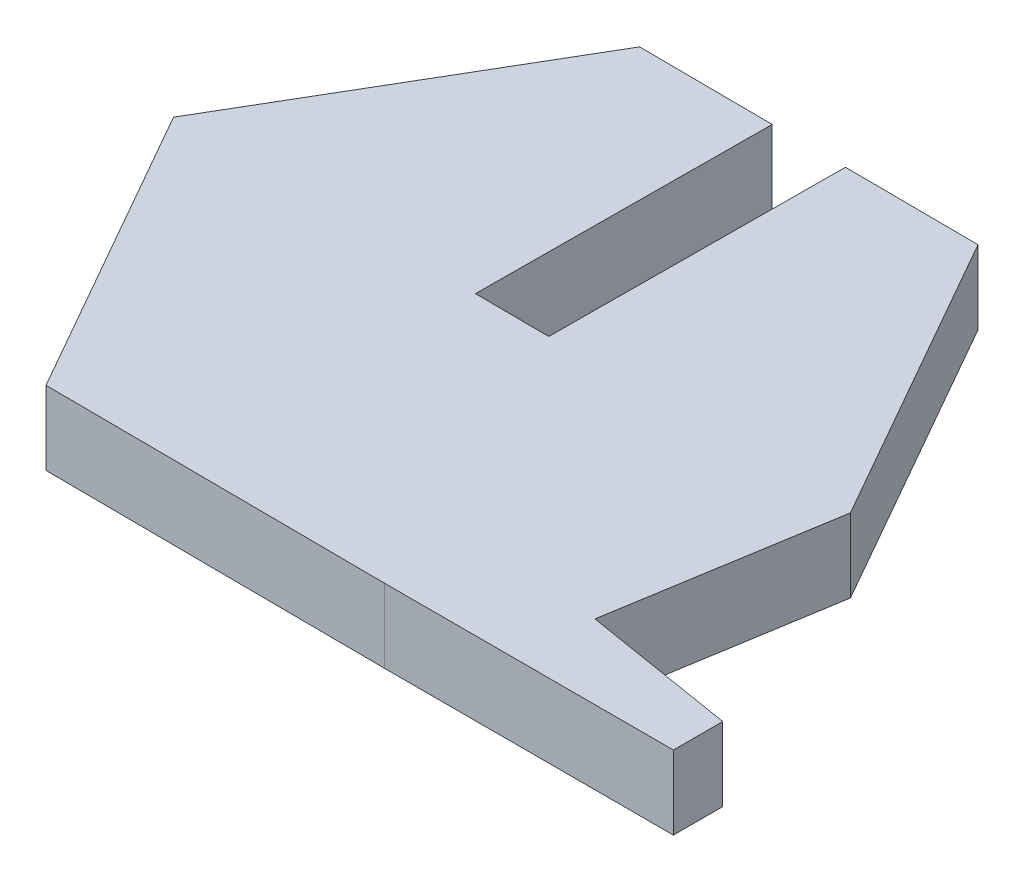
ISO-10303-21;
HEADER;
FILE_DESCRIPTION(('STEP AP214'),'2;1');
FILE_NAME('part.step','',(''),(''),'','','');
FILE_SCHEMA(('AUTOMOTIVE_DESIGN { 1 0 10303 214 1 1 1 1 }'));
ENDSEC;
DATA;
#1=APPLICATION_CONTEXT('core data for automotive mechanical design processes');
#2=APPLICATION_PROTOCOL_DEFINITION('international standard','automotive_design',2000,#1);
#3=PRODUCT_CONTEXT('',#1,'mechanical');
#4=PRODUCT('Part','Part','',(#3));
#5=PRODUCT_RELATED_PRODUCT_CATEGORY('part','',(#4));
#6=PRODUCT_DEFINITION_FORMATION('','',#4);
#7=PRODUCT_DEFINITION_CONTEXT('part definition',#1,'design');
#8=PRODUCT_DEFINITION('design','',#6,#7);
#9=PRODUCT_DEFINITION_SHAPE('','',#8);
#10=(LENGTH_UNIT() NAMED_UNIT(*) SI_UNIT(.MILLI.,.METRE.));
#11=(NAMED_UNIT(*) PLANE_ANGLE_UNIT() SI_UNIT($,.RADIAN.));
#12=(NAMED_UNIT(*) SI_UNIT($,.STERADIAN.) SOLID_ANGLE_UNIT());
#13=UNCERTAINTY_MEASURE_WITH_UNIT(LENGTH_MEASURE(1.E-05),#10,'distance_accuracy_value','');
#14=(GEOMETRIC_REPRESENTATION_CONTEXT(3) GLOBAL_UNCERTAINTY_ASSIGNED_CONTEXT((#13)) GLOBAL_UNIT_ASSIGNED_CONTEXT((#10,
#11,#12)) REPRESENTATION_CONTEXT('',''));
#15=CARTESIAN_POINT('',(0.,0.,0.));
#16=DIRECTION('',(0.,0.,1.));
#17=DIRECTION('',(1.,0.,0.));
#18=AXIS2_PLACEMENT_3D('',#15,#16,#17);
#19=CARTESIAN_POINT('',(5.83595826477384,2.5,-9.96368026710769));
#20=DIRECTION('',(-0.00625685853298923,0.,0.999980425669072));
#21=DIRECTION('',(0.999980425669072,0.,0.00625685853298923));
#22=AXIS2_PLACEMENT_3D('',#19,#20,#21);
#23=PLANE('',#22);
#24=DIRECTION('',(-0.999980425669072,0.,-0.00625685853298923));
#25=VECTOR('',#24,1.);
#26=CARTESIAN_POINT('',(5.83595826477384,2.5,-9.96368026710769));
#27=LINE('',#26,#25);
#28=CARTESIAN_POINT('',(-1.18441238916657,2.5,-10.007606592967));
#29=VERTEX_POINT('',#28);
#30=CARTESIAN_POINT('',(-5.71082109411406,2.5,-10.0359282462737));
#31=VERTEX_POINT('',#30);
#32=EDGE_CURVE('E287',#29,#31,#27,.T.);
#33=ORIENTED_EDGE('',*,*,#32,.F.);
#34=DIRECTION('',(0.,1.,0.));
#35=VECTOR('',#34,1.);
#36=CARTESIAN_POINT('',(-1.18441238916657,2.5,-10.007606592967));
#37=LINE('',#36,#35);
#38=CARTESIAN_POINT('',(-1.18441238916657,0.,-10.007606592967));
#39=VERTEX_POINT('',#38);
#40=EDGE_CURVE('E253',#39,#29,#37,.T.);
#41=ORIENTED_EDGE('',*,*,#40,.F.);
#42=DIRECTION('',(-0.999980425669072,0.,-0.00625685853298923));
#43=VECTOR('',#42,1.);
#44=CARTESIAN_POINT('',(5.83595826477384,0.,-9.96368026710769));
#45=LINE('',#44,#43);
#46=CARTESIAN_POINT('',(-5.71082109411406,0.,-10.0359282462737));
#47=VERTEX_POINT('',#46);
#48=EDGE_CURVE('E171',#39,#47,#45,.T.);
#49=ORIENTED_EDGE('',*,*,#48,.T.);
#50=DIRECTION('',(0.,-1.,0.));
#51=VECTOR('',#50,1.);
#52=CARTESIAN_POINT('',(-5.71082109411406,2.5,-10.0359282462737));
#53=LINE('',#52,#51);
#54=EDGE_CURVE('E200',#31,#47,#53,.T.);
#55=ORIENTED_EDGE('',*,*,#54,.F.);
#56=EDGE_LOOP('',(#33,#41,#49,#55));
#57=FACE_BOUND('',#56,.T.);
#58=ADVANCED_FACE('F39',(#57),#23,.F.);
#59=CARTESIAN_POINT('',(10.3298675672944,2.5,7.51644835181177));
#60=DIRECTION('',(-0.161329742323625,0.,0.986900559449529));
#61=DIRECTION('',(0.986900559449529,0.,0.161329742323625));
#62=AXIS2_PLACEMENT_3D('',#59,#60,#61);
#63=PLANE('',#62);
#64=DIRECTION('',(-0.986900559449529,0.,-0.161329742323625));
#65=VECTOR('',#64,1.);
#66=CARTESIAN_POINT('',(10.3298675672944,0.,7.51644835181177));
#67=LINE('',#66,#65);
#68=CARTESIAN_POINT('',(15.5082419016361,0.,8.36296301736289));
#69=VERTEX_POINT('',#68);
#70=CARTESIAN_POINT('',(10.3298675672944,0.,7.51644835181177));
#71=VERTEX_POINT('',#70);
#72=EDGE_CURVE('E160',#69,#71,#67,.T.);
#73=ORIENTED_EDGE('',*,*,#72,.T.);
#74=DIRECTION('',(0.,-1.,0.));
#75=VECTOR('',#74,1.);
#76=CARTESIAN_POINT('',(10.3298675672944,2.5,7.51644835181177));
#77=LINE('',#76,#75);
#78=CARTESIAN_POINT('',(10.3298675672944,2.5,7.51644835181177));
#79=VERTEX_POINT('',#78);
#80=EDGE_CURVE('E11',#79,#71,#77,.T.);
#81=ORIENTED_EDGE('',*,*,#80,.F.);
#82=DIRECTION('',(-0.986900559449529,0.,-0.161329742323625));
#83=VECTOR('',#82,1.);
#84=CARTESIAN_POINT('',(10.3298675672944,2.5,7.51644835181177));
#85=LINE('',#84,#83);
#86=CARTESIAN_POINT('',(15.5082419016361,2.5,8.36296301736289));
#87=VERTEX_POINT('',#86);
#88=EDGE_CURVE('E189',#87,#79,#85,.T.);
#89=ORIENTED_EDGE('',*,*,#88,.F.);
#90=DIRECTION('',(0.,-1.,0.));
#91=VECTOR('',#90,1.);
#92=CARTESIAN_POINT('',(15.5082419016361,2.5,8.36296301736289));
#93=LINE('',#92,#91);
#94=EDGE_CURVE('E156',#87,#69,#93,.T.);
#95=ORIENTED_EDGE('',*,*,#94,.T.);
#96=EDGE_LOOP('',(#73,#81,#89,#95));
#97=FACE_BOUND('',#96,.T.);
#98=ADVANCED_FACE('F41',(#97),#63,.F.);
#99=CARTESIAN_POINT('',(11.5467793588879,2.5,0.0722479791660558));
#100=DIRECTION('',(-0.986900559449529,0.,-0.161329742323625));
#101=DIRECTION('',(-0.161329742323625,0.,0.986900559449529));
#102=AXIS2_PLACEMENT_3D('',#99,#100,#101);
#103=PLANE('',#102);
#104=DIRECTION('',(0.161329742323625,0.,-0.986900559449529));
#105=VECTOR('',#104,1.);
#106=CARTESIAN_POINT('',(11.5467793588879,0.,0.0722479791660558));
#107=LINE('',#106,#105);
#108=CARTESIAN_POINT('',(11.5467793588879,0.,0.0722479791660558));
#109=VERTEX_POINT('',#108);
#110=EDGE_CURVE('E164',#71,#109,#107,.T.);
#111=ORIENTED_EDGE('',*,*,#110,.T.);
#112=DIRECTION('',(0.,-1.,0.));
#113=VECTOR('',#112,1.);
#114=CARTESIAN_POINT('',(11.5467793588879,2.5,0.0722479791660558));
#115=LINE('',#114,#113);
#116=CARTESIAN_POINT('',(11.5467793588879,2.5,0.0722479791660558));
#117=VERTEX_POINT('',#116);
#118=EDGE_CURVE('E48',#117,#109,#115,.T.);
#119=ORIENTED_EDGE('',*,*,#118,.F.);
#120=DIRECTION('',(0.161329742323625,0.,-0.986900559449529));
#121=VECTOR('',#120,1.);
#122=CARTESIAN_POINT('',(11.5467793588879,2.5,0.0722479791660558));
#123=LINE('',#122,#121);
#124=EDGE_CURVE('E108',#79,#117,#123,.T.);
#125=ORIENTED_EDGE('',*,*,#124,.F.);
#126=ORIENTED_EDGE('',*,*,#80,.T.);
#127=EDGE_LOOP('',(#111,#119,#125,#126));
#128=FACE_BOUND('',#127,.T.);
#129=ADVANCED_FACE('F320',(#128),#103,.F.);
#130=CARTESIAN_POINT('',(11.5467793588879,2.5,0.0722479791660558));
#131=DIRECTION('',(-0.869136881183087,0.,0.494571614397082));
#132=DIRECTION('',(0.494571614397082,0.,0.869136881183087));
#133=AXIS2_PLACEMENT_3D('',#130,#131,#132);
#134=PLANE('',#133);
#135=DIRECTION('',(-0.494571614397082,0.,-0.869136881183087));
#136=VECTOR('',#135,1.);
#137=CARTESIAN_POINT('',(11.5467793588879,0.,0.0722479791660558));
#138=LINE('',#137,#136);
#139=CARTESIAN_POINT('',(5.83595826477384,0.,-9.96368026710769));
#140=VERTEX_POINT('',#139);
#141=EDGE_CURVE('E168',#109,#140,#138,.T.);
#142=ORIENTED_EDGE('',*,*,#141,.T.);
#143=DIRECTION('',(0.,-1.,0.));
#144=VECTOR('',#143,1.);
#145=CARTESIAN_POINT('',(5.83595826477384,2.5,-9.96368026710769));
#146=LINE('',#145,#144);
#147=CARTESIAN_POINT('',(5.83595826477384,2.5,-9.96368026710769));
#148=VERTEX_POINT('',#147);
#149=EDGE_CURVE('E204',#148,#140,#146,.T.);
#150=ORIENTED_EDGE('',*,*,#149,.F.);
#151=DIRECTION('',(-0.494571614397082,0.,-0.869136881183087));
#152=VECTOR('',#151,1.);
#153=CARTESIAN_POINT('',(11.5467793588879,2.5,0.0722479791660558));
#154=LINE('',#153,#152);
#155=EDGE_CURVE('E214',#117,#148,#154,.T.);
#156=ORIENTED_EDGE('',*,*,#155,.F.);
#157=ORIENTED_EDGE('',*,*,#118,.T.);
#158=EDGE_LOOP('',(#142,#150,#156,#157));
#159=FACE_BOUND('',#158,.T.);
#160=ADVANCED_FACE('F212',(#159),#134,.F.);
#161=CARTESIAN_POINT('',(1.31553867500611,0.,-9.99196444663451));
#162=VERTEX_POINT('',#161);
#163=EDGE_CURVE('E172',#140,#162,#45,.T.);
#164=ORIENTED_EDGE('',*,*,#163,.T.);
#165=DIRECTION('',(0.,-1.,0.));
#166=VECTOR('',#165,1.);
#167=CARTESIAN_POINT('',(1.31553867500611,2.5,-9.99196444663451));
#168=LINE('',#167,#166);
#169=CARTESIAN_POINT('',(1.31553867500611,2.5,-9.99196444663451));
#170=VERTEX_POINT('',#169);
#171=EDGE_CURVE('E230',#170,#162,#168,.T.);
#172=ORIENTED_EDGE('',*,*,#171,.F.);
#173=EDGE_CURVE('E288',#148,#170,#27,.T.);
#174=ORIENTED_EDGE('',*,*,#173,.F.);
#175=ORIENTED_EDGE('',*,*,#149,.T.);
#176=EDGE_LOOP('',(#164,#172,#174,#175));
#177=FACE_BOUND('',#176,.T.);
#178=ADVANCED_FACE('F226',(#177),#23,.F.);
#179=CARTESIAN_POINT('',(-5.71082109411406,2.5,-10.0359282462737));
#180=DIRECTION('',(0.862880022650098,0.,0.50540881127199));
#181=DIRECTION('',(0.50540881127199,0.,-0.862880022650098));
#182=AXIS2_PLACEMENT_3D('',#179,#180,#181);
#183=PLANE('',#182);
#184=DIRECTION('',(-0.50540881127199,0.,0.862880022650098));
#185=VECTOR('',#184,1.);
#186=CARTESIAN_POINT('',(-5.71082109411406,0.,-10.0359282462737));
#187=LINE('',#186,#185);
#188=CARTESIAN_POINT('',(-11.5467793588879,0.,-0.0722479791660576));
#189=VERTEX_POINT('',#188);
#190=EDGE_CURVE('E176',#47,#189,#187,.T.);
#191=ORIENTED_EDGE('',*,*,#190,.T.);
#192=DIRECTION('',(0.,-1.,0.));
#193=VECTOR('',#192,1.);
#194=CARTESIAN_POINT('',(-11.5467793588879,2.5,-0.0722479791660576));
#195=LINE('',#194,#193);
#196=CARTESIAN_POINT('',(-11.5467793588879,2.5,-0.0722479791660576));
#197=VERTEX_POINT('',#196);
#198=EDGE_CURVE('E196',#197,#189,#195,.T.);
#199=ORIENTED_EDGE('',*,*,#198,.F.);
#200=DIRECTION('',(-0.50540881127199,0.,0.862880022650098));
#201=VECTOR('',#200,1.);
#202=CARTESIAN_POINT('',(-5.71082109411406,2.5,-10.0359282462737));
#203=LINE('',#202,#201);
#204=EDGE_CURVE('E291',#31,#197,#203,.T.);
#205=ORIENTED_EDGE('',*,*,#204,.F.);
#206=ORIENTED_EDGE('',*,*,#54,.T.);
#207=EDGE_LOOP('',(#191,#199,#205,#206));
#208=FACE_BOUND('',#207,.T.);
#209=ADVANCED_FACE('F302',(#208),#183,.F.);
#210=CARTESIAN_POINT('',(-11.5467793588879,2.5,-0.0722479791660576));
#211=DIRECTION('',(0.869136881183088,0.,-0.494571614397082));
#212=DIRECTION('',(-0.494571614397082,0.,-0.869136881183088));
#213=AXIS2_PLACEMENT_3D('',#210,#211,#212);
#214=PLANE('',#213);
#215=DIRECTION('',(0.494571614397082,0.,0.869136881183088));
#216=VECTOR('',#215,1.);
#217=CARTESIAN_POINT('',(-11.5467793588879,0.,-0.0722479791660576));
#218=LINE('',#217,#216);
#219=CARTESIAN_POINT('',(-5.83595826477384,0.,9.96368026710769));
#220=VERTEX_POINT('',#219);
#221=EDGE_CURVE('E179',#189,#220,#218,.T.);
#222=ORIENTED_EDGE('',*,*,#221,.T.);
#223=DIRECTION('',(0.,-1.,0.));
#224=VECTOR('',#223,1.);
#225=CARTESIAN_POINT('',(-5.83595826477384,2.5,9.96368026710769));
#226=LINE('',#225,#224);
#227=CARTESIAN_POINT('',(-5.83595826477384,2.5,9.96368026710769));
#228=VERTEX_POINT('',#227);
#229=EDGE_CURVE('E149',#228,#220,#226,.T.);
#230=ORIENTED_EDGE('',*,*,#229,.F.);
#231=DIRECTION('',(0.494571614397082,0.,0.869136881183088));
#232=VECTOR('',#231,1.);
#233=CARTESIAN_POINT('',(-11.5467793588879,2.5,-0.0722479791660576));
#234=LINE('',#233,#232);
#235=EDGE_CURVE('E135',#197,#228,#234,.T.);
#236=ORIENTED_EDGE('',*,*,#235,.F.);
#237=ORIENTED_EDGE('',*,*,#198,.T.);
#238=EDGE_LOOP('',(#222,#230,#236,#237));
#239=FACE_BOUND('',#238,.T.);
#240=ADVANCED_FACE('F306',(#239),#214,.F.);
#241=CARTESIAN_POINT('',(-5.83595826477384,2.5,9.96368026710769));
#242=DIRECTION('',(0.00625685853298938,0.,-0.999980425669072));
#243=DIRECTION('',(-0.999980425669072,0.,-0.00625685853298938));
#244=AXIS2_PLACEMENT_3D('',#241,#242,#243);
#245=PLANE('',#244);
#246=DIRECTION('',(0.999980425669072,0.,0.00625685853298938));
#247=VECTOR('',#246,1.);
#248=CARTESIAN_POINT('',(-5.83595826477384,0.,9.96368026710769));
#249=LINE('',#248,#247);
#250=CARTESIAN_POINT('',(5.71082109411406,0.,10.0359282462737));
#251=VERTEX_POINT('',#250);
#252=EDGE_CURVE('E145',#220,#251,#249,.T.);
#253=ORIENTED_EDGE('',*,*,#252,.T.);
#254=DIRECTION('',(0.,-1.,0.));
#255=VECTOR('',#254,1.);
#256=CARTESIAN_POINT('',(5.71082109411406,2.5,10.0359282462737));
#257=LINE('',#256,#255);
#258=CARTESIAN_POINT('',(5.71082109411406,2.5,10.0359282462737));
#259=VERTEX_POINT('',#258);
#260=EDGE_CURVE('E142',#259,#251,#257,.T.);
#261=ORIENTED_EDGE('',*,*,#260,.F.);
#262=DIRECTION('',(0.999980425669072,0.,0.00625685853298938));
#263=VECTOR('',#262,1.);
#264=CARTESIAN_POINT('',(-5.83595826477384,2.5,9.96368026710769));
#265=LINE('',#264,#263);
#266=EDGE_CURVE('E127',#228,#259,#265,.T.);
#267=ORIENTED_EDGE('',*,*,#266,.F.);
#268=ORIENTED_EDGE('',*,*,#229,.T.);
#269=EDGE_LOOP('',(#253,#261,#267,#268));
#270=FACE_BOUND('',#269,.T.);
#271=ADVANCED_FACE('F143',(#270),#245,.F.);
#272=CARTESIAN_POINT('',(15.5082419016361,2.5,10.0359282462737));
#273=DIRECTION('',(0.,0.,-1.));
#274=DIRECTION('',(-1.,0.,0.));
#275=AXIS2_PLACEMENT_3D('',#272,#273,#274);
#276=PLANE('',#275);
#277=DIRECTION('',(1.,0.,0.));
#278=VECTOR('',#277,1.);
#279=CARTESIAN_POINT('',(15.5082419016361,0.,10.0359282462737));
#280=LINE('',#279,#278);
#281=CARTESIAN_POINT('',(15.5082419016361,0.,10.0359282462737));
#282=VERTEX_POINT('',#281);
#283=EDGE_CURVE('E184',#251,#282,#280,.T.);
#284=ORIENTED_EDGE('',*,*,#283,.T.);
#285=DIRECTION('',(0.,-1.,0.));
#286=VECTOR('',#285,1.);
#287=CARTESIAN_POINT('',(15.5082419016361,2.5,10.0359282462737));
#288=LINE('',#287,#286);
#289=CARTESIAN_POINT('',(15.5082419016361,2.5,10.0359282462737));
#290=VERTEX_POINT('',#289);
#291=EDGE_CURVE('E150',#290,#282,#288,.T.);
#292=ORIENTED_EDGE('',*,*,#291,.F.);
#293=DIRECTION('',(1.,0.,0.));
#294=VECTOR('',#293,1.);
#295=CARTESIAN_POINT('',(15.5082419016361,2.5,10.0359282462737));
#296=LINE('',#295,#294);
#297=EDGE_CURVE('E132',#259,#290,#296,.T.);
#298=ORIENTED_EDGE('',*,*,#297,.F.);
#299=ORIENTED_EDGE('',*,*,#260,.T.);
#300=EDGE_LOOP('',(#284,#292,#298,#299));
#301=FACE_BOUND('',#300,.T.);
#302=ADVANCED_FACE('F152',(#301),#276,.F.);
#303=CARTESIAN_POINT('',(15.5082419016361,2.5,8.36296301736289));
#304=DIRECTION('',(-1.,0.,0.));
#305=DIRECTION('',(0.,0.,1.));
#306=AXIS2_PLACEMENT_3D('',#303,#304,#305);
#307=PLANE('',#306);
#308=DIRECTION('',(0.,0.,-1.));
#309=VECTOR('',#308,1.);
#310=CARTESIAN_POINT('',(15.5082419016361,0.,8.36296301736289));
#311=LINE('',#310,#309);
#312=EDGE_CURVE('E100',#282,#69,#311,.T.);
#313=ORIENTED_EDGE('',*,*,#312,.T.);
#314=ORIENTED_EDGE('',*,*,#94,.F.);
#315=DIRECTION('',(0.,0.,-1.));
#316=VECTOR('',#315,1.);
#317=CARTESIAN_POINT('',(15.5082419016361,2.5,8.36296301736289));
#318=LINE('',#317,#316);
#319=EDGE_CURVE('E64',#290,#87,#318,.T.);
#320=ORIENTED_EDGE('',*,*,#319,.F.);
#321=ORIENTED_EDGE('',*,*,#291,.T.);
#322=EDGE_LOOP('',(#313,#314,#320,#321));
#323=FACE_BOUND('',#322,.T.);
#324=ADVANCED_FACE('F334',(#323),#307,.F.);
#325=CARTESIAN_POINT('',(0.,2.5,0.));
#326=DIRECTION('',(0.,-1.,0.));
#327=DIRECTION('',(0.,0.,-1.));
#328=AXIS2_PLACEMENT_3D('',#325,#326,#327);
#329=PLANE('',#328);
#330=DIRECTION('',(0.999980425669072,0.,0.00625685853298877));
#331=VECTOR('',#330,1.);
#332=CARTESIAN_POINT('',(-1.24698097449646,2.5,-0.00780233627626324));
#333=LINE('',#332,#331);
#334=CARTESIAN_POINT('',(-1.24698097449646,2.5,-0.00780233627626324));
#335=VERTEX_POINT('',#334);
#336=CARTESIAN_POINT('',(1.25297008967622,2.5,0.00783981005620868));
#337=VERTEX_POINT('',#336);
#338=EDGE_CURVE('E260',#335,#337,#333,.T.);
#339=ORIENTED_EDGE('',*,*,#338,.F.);
#340=DIRECTION('',(0.00625685853298924,0.,-0.999980425669072));
#341=VECTOR('',#340,1.);
#342=CARTESIAN_POINT('',(-1.24698097449646,2.5,-0.00780233627626324));
#343=LINE('',#342,#341);
#344=EDGE_CURVE('E248',#335,#29,#343,.T.);
#345=ORIENTED_EDGE('',*,*,#344,.T.);
#346=ORIENTED_EDGE('',*,*,#32,.T.);
#347=ORIENTED_EDGE('',*,*,#204,.T.);
#348=ORIENTED_EDGE('',*,*,#235,.T.);
#349=ORIENTED_EDGE('',*,*,#266,.T.);
#350=ORIENTED_EDGE('',*,*,#297,.T.);
#351=ORIENTED_EDGE('',*,*,#319,.T.);
#352=ORIENTED_EDGE('',*,*,#88,.T.);
#353=ORIENTED_EDGE('',*,*,#124,.T.);
#354=ORIENTED_EDGE('',*,*,#155,.T.);
#355=ORIENTED_EDGE('',*,*,#173,.T.);
#356=DIRECTION('',(0.00625685853298924,0.,-0.999980425669072));
#357=VECTOR('',#356,1.);
#358=CARTESIAN_POINT('',(1.25297008967622,2.5,0.00783981005620868));
#359=LINE('',#358,#357);
#360=EDGE_CURVE('E256',#337,#170,#359,.T.);
#361=ORIENTED_EDGE('',*,*,#360,.F.);
#362=EDGE_LOOP('',(#339,#345,#346,#347,#348,#349,#350,#351,#352,#353,#354,#355,#361));
#363=FACE_BOUND('',#362,.T.);
#364=ADVANCED_FACE('F130',(#363),#329,.F.);
#365=CARTESIAN_POINT('',(0.,0.,0.));
#366=DIRECTION('',(0.,-1.,0.));
#367=DIRECTION('',(0.,0.,-1.));
#368=AXIS2_PLACEMENT_3D('',#365,#366,#367);
#369=PLANE('',#368);
#370=DIRECTION('',(0.00625685853298924,0.,-0.999980425669072));
#371=VECTOR('',#370,1.);
#372=CARTESIAN_POINT('',(-1.24698097449646,0.,-0.00780233627626324));
#373=LINE('',#372,#371);
#374=CARTESIAN_POINT('',(-1.24698097449646,0.,-0.00780233627626324));
#375=VERTEX_POINT('',#374);
#376=EDGE_CURVE('E165',#375,#39,#373,.T.);
#377=ORIENTED_EDGE('',*,*,#376,.F.);
#378=DIRECTION('',(-0.999980425669072,0.,-0.00625685853298877));
#379=VECTOR('',#378,1.);
#380=CARTESIAN_POINT('',(-1.24698097449646,0.,-0.00780233627626324));
#381=LINE('',#380,#379);
#382=CARTESIAN_POINT('',(1.25297008967622,0.,0.00783981005621029));
#383=VERTEX_POINT('',#382);
#384=EDGE_CURVE('E257',#383,#375,#381,.T.);
#385=ORIENTED_EDGE('',*,*,#384,.F.);
#386=DIRECTION('',(0.00625685853298924,0.,-0.999980425669072));
#387=VECTOR('',#386,1.);
#388=CARTESIAN_POINT('',(1.25297008967622,0.,0.00783981005620868));
#389=LINE('',#388,#387);
#390=EDGE_CURVE('E223',#383,#162,#389,.T.);
#391=ORIENTED_EDGE('',*,*,#390,.T.);
#392=ORIENTED_EDGE('',*,*,#163,.F.);
#393=ORIENTED_EDGE('',*,*,#141,.F.);
#394=ORIENTED_EDGE('',*,*,#110,.F.);
#395=ORIENTED_EDGE('',*,*,#72,.F.);
#396=ORIENTED_EDGE('',*,*,#312,.F.);
#397=ORIENTED_EDGE('',*,*,#283,.F.);
#398=ORIENTED_EDGE('',*,*,#252,.F.);
#399=ORIENTED_EDGE('',*,*,#221,.F.);
#400=ORIENTED_EDGE('',*,*,#190,.F.);
#401=ORIENTED_EDGE('',*,*,#48,.F.);
#402=EDGE_LOOP('',(#377,#385,#391,#392,#393,#394,#395,#396,#397,#398,#399,#400,#401));
#403=FACE_BOUND('',#402,.T.);
#404=ADVANCED_FACE('F218',(#403),#369,.T.);
#405=CARTESIAN_POINT('',(-1.24698097449646,2.5,-0.00780233627626324));
#406=DIRECTION('',(-0.999980425669072,0.,-0.00625685853298924));
#407=DIRECTION('',(-0.00625685853298924,0.,0.999980425669072));
#408=AXIS2_PLACEMENT_3D('',#405,#406,#407);
#409=PLANE('',#408);
#410=ORIENTED_EDGE('',*,*,#40,.T.);
#411=ORIENTED_EDGE('',*,*,#344,.F.);
#412=DIRECTION('',(0.,1.,0.));
#413=VECTOR('',#412,1.);
#414=CARTESIAN_POINT('',(-1.24698097449646,2.5,-0.00780233627626324));
#415=LINE('',#414,#413);
#416=EDGE_CURVE('E251',#375,#335,#415,.T.);
#417=ORIENTED_EDGE('',*,*,#416,.F.);
#418=ORIENTED_EDGE('',*,*,#376,.T.);
#419=EDGE_LOOP('',(#410,#411,#417,#418));
#420=FACE_BOUND('',#419,.T.);
#421=ADVANCED_FACE('F250',(#420),#409,.F.);
#422=CARTESIAN_POINT('',(1.25297008967622,2.5,0.00783981005620868));
#423=DIRECTION('',(0.999980425669072,0.,0.00625685853298924));
#424=DIRECTION('',(0.00625685853298924,0.,-0.999980425669072));
#425=AXIS2_PLACEMENT_3D('',#422,#423,#424);
#426=PLANE('',#425);
#427=ORIENTED_EDGE('',*,*,#171,.T.);
#428=ORIENTED_EDGE('',*,*,#390,.F.);
#429=DIRECTION('',(0.,-1.,0.));
#430=VECTOR('',#429,1.);
#431=CARTESIAN_POINT('',(1.25297008967622,2.5,0.00783981005620868));
#432=LINE('',#431,#430);
#433=EDGE_CURVE('E55',#337,#383,#432,.T.);
#434=ORIENTED_EDGE('',*,*,#433,.F.);
#435=ORIENTED_EDGE('',*,*,#360,.T.);
#436=EDGE_LOOP('',(#427,#428,#434,#435));
#437=FACE_BOUND('',#436,.T.);
#438=ADVANCED_FACE('F348',(#437),#426,.F.);
#439=CARTESIAN_POINT('',(0.,0.,0.));
#440=DIRECTION('',(-0.00625685853298877,0.,0.999980425669072));
#441=DIRECTION('',(0.999980425669072,0.,0.00625685853298877));
#442=AXIS2_PLACEMENT_3D('',#439,#440,#441);
#443=PLANE('',#442);
#444=ORIENTED_EDGE('',*,*,#416,.T.);
#445=ORIENTED_EDGE('',*,*,#338,.T.);
#446=ORIENTED_EDGE('',*,*,#433,.T.);
#447=ORIENTED_EDGE('',*,*,#384,.T.);
#448=EDGE_LOOP('',(#444,#445,#446,#447));
#449=FACE_BOUND('',#448,.T.);
#450=ADVANCED_FACE('F259',(#449),#443,.F.);
#451=CLOSED_SHELL('',(#58,#98,#129,#160,#178,#209,#240,#271,#302,#324,#364,#404,#421,#438,#450));
#452=MANIFOLD_SOLID_BREP('B2',#451);
#453=ADVANCED_BREP_SHAPE_REPRESENTATION('',(#18,#452),#14);
#454=SHAPE_DEFINITION_REPRESENTATION(#9,#453);
ENDSEC;
END-ISO-10303-21;
